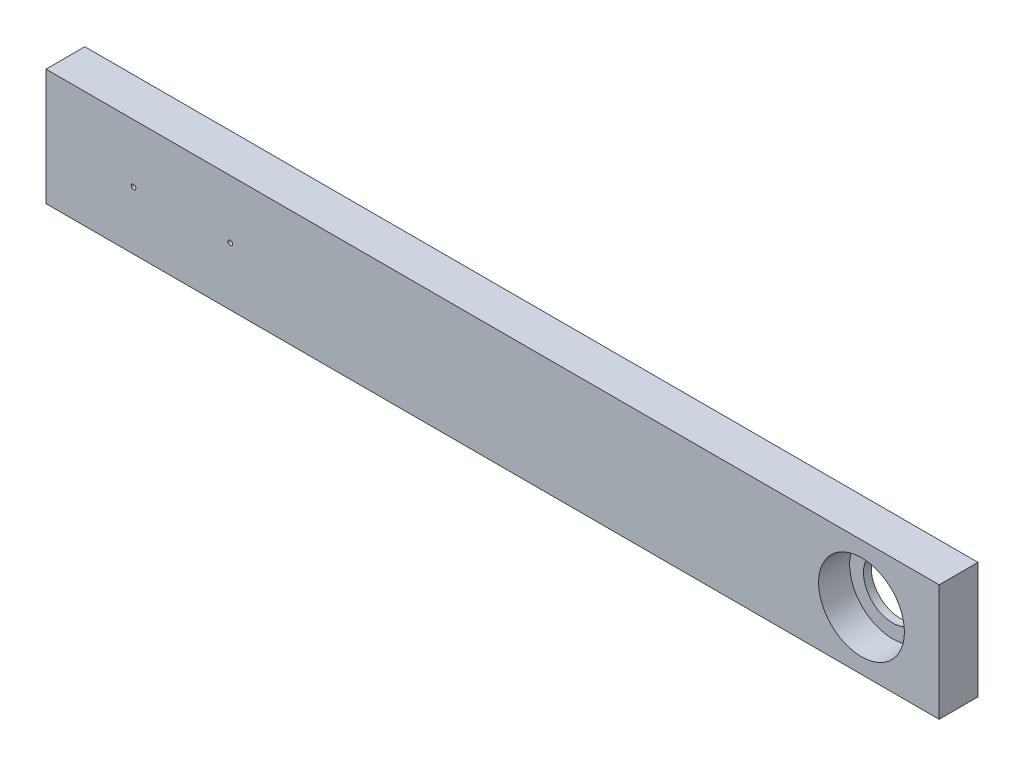
ISO-10303-21;
HEADER;
FILE_DESCRIPTION(('STEP AP214'),'2;1');
FILE_NAME('part.step','',(''),(''),'','','');
FILE_SCHEMA(('AUTOMOTIVE_DESIGN { 1 0 10303 214 1 1 1 1 }'));
ENDSEC;
DATA;
#1=APPLICATION_CONTEXT('core data for automotive mechanical design processes');
#2=APPLICATION_PROTOCOL_DEFINITION('international standard','automotive_design',2000,#1);
#3=PRODUCT_CONTEXT('',#1,'mechanical');
#4=PRODUCT('Part','Part','',(#3));
#5=PRODUCT_RELATED_PRODUCT_CATEGORY('part','',(#4));
#6=PRODUCT_DEFINITION_FORMATION('','',#4);
#7=PRODUCT_DEFINITION_CONTEXT('part definition',#1,'design');
#8=PRODUCT_DEFINITION('design','',#6,#7);
#9=PRODUCT_DEFINITION_SHAPE('','',#8);
#10=(LENGTH_UNIT() NAMED_UNIT(*) SI_UNIT(.MILLI.,.METRE.));
#11=(NAMED_UNIT(*) PLANE_ANGLE_UNIT() SI_UNIT($,.RADIAN.));
#12=(NAMED_UNIT(*) SI_UNIT($,.STERADIAN.) SOLID_ANGLE_UNIT());
#13=UNCERTAINTY_MEASURE_WITH_UNIT(LENGTH_MEASURE(1.E-05),#10,'distance_accuracy_value','');
#14=(GEOMETRIC_REPRESENTATION_CONTEXT(3) GLOBAL_UNCERTAINTY_ASSIGNED_CONTEXT((#13)) GLOBAL_UNIT_ASSIGNED_CONTEXT((#10,
#11,#12)) REPRESENTATION_CONTEXT('',''));
#15=CARTESIAN_POINT('',(0.,0.,0.));
#16=DIRECTION('',(0.,0.,1.));
#17=DIRECTION('',(1.,0.,0.));
#18=AXIS2_PLACEMENT_3D('',#15,#16,#17);
#19=CARTESIAN_POINT('',(0.,0.,10.));
#20=DIRECTION('',(0.,1.,0.));
#21=DIRECTION('',(-1.,0.,0.));
#22=AXIS2_PLACEMENT_3D('',#19,#20,#21);
#23=PLANE('',#22);
#24=DIRECTION('',(1.,0.,0.));
#25=VECTOR('',#24,1.);
#26=CARTESIAN_POINT('',(0.,0.,0.));
#27=LINE('',#26,#25);
#28=CARTESIAN_POINT('',(0.,0.,0.));
#29=VERTEX_POINT('',#28);
#30=CARTESIAN_POINT('',(230.,0.,0.));
#31=VERTEX_POINT('',#30);
#32=EDGE_CURVE('E112',#29,#31,#27,.T.);
#33=ORIENTED_EDGE('',*,*,#32,.T.);
#34=DIRECTION('',(0.,0.,-1.));
#35=VECTOR('',#34,1.);
#36=CARTESIAN_POINT('',(230.,0.,10.));
#37=LINE('',#36,#35);
#38=CARTESIAN_POINT('',(230.,0.,10.));
#39=VERTEX_POINT('',#38);
#40=EDGE_CURVE('E48',#39,#31,#37,.T.);
#41=ORIENTED_EDGE('',*,*,#40,.F.);
#42=DIRECTION('',(1.,0.,0.));
#43=VECTOR('',#42,1.);
#44=CARTESIAN_POINT('',(0.,0.,10.));
#45=LINE('',#44,#43);
#46=CARTESIAN_POINT('',(0.,0.,10.));
#47=VERTEX_POINT('',#46);
#48=EDGE_CURVE('E80',#47,#39,#45,.T.);
#49=ORIENTED_EDGE('',*,*,#48,.F.);
#50=DIRECTION('',(0.,0.,-1.));
#51=VECTOR('',#50,1.);
#52=CARTESIAN_POINT('',(0.,0.,10.));
#53=LINE('',#52,#51);
#54=EDGE_CURVE('E111',#47,#29,#53,.T.);
#55=ORIENTED_EDGE('',*,*,#54,.T.);
#56=EDGE_LOOP('',(#33,#41,#49,#55));
#57=FACE_BOUND('',#56,.T.);
#58=ADVANCED_FACE('F39',(#57),#23,.F.);
#59=CARTESIAN_POINT('',(230.,0.,10.));
#60=DIRECTION('',(1.,0.,0.));
#61=DIRECTION('',(0.,0.,-1.));
#62=AXIS2_PLACEMENT_3D('',#59,#60,#61);
#63=PLANE('',#62);
#64=DIRECTION('',(0.,-1.,0.));
#65=VECTOR('',#64,1.);
#66=CARTESIAN_POINT('',(230.,0.,0.));
#67=LINE('',#66,#65);
#68=CARTESIAN_POINT('',(230.,30.,0.));
#69=VERTEX_POINT('',#68);
#70=EDGE_CURVE('E90',#69,#31,#67,.T.);
#71=ORIENTED_EDGE('',*,*,#70,.F.);
#72=DIRECTION('',(0.,0.,-1.));
#73=VECTOR('',#72,1.);
#74=CARTESIAN_POINT('',(230.,30.,10.));
#75=LINE('',#74,#73);
#76=CARTESIAN_POINT('',(230.,30.,10.));
#77=VERTEX_POINT('',#76);
#78=EDGE_CURVE('E86',#77,#69,#75,.T.);
#79=ORIENTED_EDGE('',*,*,#78,.F.);
#80=DIRECTION('',(0.,-1.,0.));
#81=VECTOR('',#80,1.);
#82=CARTESIAN_POINT('',(230.,0.,10.));
#83=LINE('',#82,#81);
#84=EDGE_CURVE('E88',#77,#39,#83,.T.);
#85=ORIENTED_EDGE('',*,*,#84,.T.);
#86=ORIENTED_EDGE('',*,*,#40,.T.);
#87=EDGE_LOOP('',(#71,#79,#85,#86));
#88=FACE_BOUND('',#87,.T.);
#89=ADVANCED_FACE('F87',(#88),#63,.T.);
#90=CARTESIAN_POINT('',(0.,30.,10.));
#91=DIRECTION('',(0.,1.,0.));
#92=DIRECTION('',(-1.,0.,0.));
#93=AXIS2_PLACEMENT_3D('',#90,#91,#92);
#94=PLANE('',#93);
#95=DIRECTION('',(1.,0.,0.));
#96=VECTOR('',#95,1.);
#97=CARTESIAN_POINT('',(0.,30.,0.));
#98=LINE('',#97,#96);
#99=CARTESIAN_POINT('',(0.,30.,0.));
#100=VERTEX_POINT('',#99);
#101=EDGE_CURVE('E117',#100,#69,#98,.T.);
#102=ORIENTED_EDGE('',*,*,#101,.F.);
#103=DIRECTION('',(0.,0.,-1.));
#104=VECTOR('',#103,1.);
#105=CARTESIAN_POINT('',(0.,30.,10.));
#106=LINE('',#105,#104);
#107=CARTESIAN_POINT('',(0.,30.,10.));
#108=VERTEX_POINT('',#107);
#109=EDGE_CURVE('E72',#108,#100,#106,.T.);
#110=ORIENTED_EDGE('',*,*,#109,.F.);
#111=DIRECTION('',(1.,0.,0.));
#112=VECTOR('',#111,1.);
#113=CARTESIAN_POINT('',(0.,30.,10.));
#114=LINE('',#113,#112);
#115=EDGE_CURVE('E98',#108,#77,#114,.T.);
#116=ORIENTED_EDGE('',*,*,#115,.T.);
#117=ORIENTED_EDGE('',*,*,#78,.T.);
#118=EDGE_LOOP('',(#102,#110,#116,#117));
#119=FACE_BOUND('',#118,.T.);
#120=ADVANCED_FACE('F100',(#119),#94,.T.);
#121=CARTESIAN_POINT('',(22.55,15.,10.));
#122=DIRECTION('',(0.,0.,-1.));
#123=DIRECTION('',(-1.,0.,0.));
#124=AXIS2_PLACEMENT_3D('',#121,#122,#123);
#125=CYLINDRICAL_SURFACE('',#124,0.6);
#126=CARTESIAN_POINT('',(22.55,15.,10.));
#127=DIRECTION('',(0.,0.,1.));
#128=DIRECTION('',(1.,0.,0.));
#129=AXIS2_PLACEMENT_3D('',#126,#127,#128);
#130=CIRCLE('',#129,0.6);
#131=CARTESIAN_POINT('',(23.15,15.,10.));
#132=VERTEX_POINT('',#131);
#133=EDGE_CURVE('E102',#132,#132,#130,.T.);
#134=ORIENTED_EDGE('',*,*,#133,.T.);
#135=EDGE_LOOP('',(#134));
#136=FACE_BOUND('',#135,.T.);
#137=CARTESIAN_POINT('',(22.55,15.,0.));
#138=DIRECTION('',(0.,0.,1.));
#139=DIRECTION('',(1.,0.,0.));
#140=AXIS2_PLACEMENT_3D('',#137,#138,#139);
#141=CIRCLE('',#140,0.6);
#142=CARTESIAN_POINT('',(23.15,15.,0.));
#143=VERTEX_POINT('',#142);
#144=EDGE_CURVE('E120',#143,#143,#141,.T.);
#145=ORIENTED_EDGE('',*,*,#144,.F.);
#146=EDGE_LOOP('',(#145));
#147=FACE_BOUND('',#146,.T.);
#148=ADVANCED_FACE('F169',(#136,#147),#125,.F.);
#149=CARTESIAN_POINT('',(0.,0.,10.));
#150=DIRECTION('',(1.,0.,0.));
#151=DIRECTION('',(0.,0.,-1.));
#152=AXIS2_PLACEMENT_3D('',#149,#150,#151);
#153=PLANE('',#152);
#154=DIRECTION('',(0.,-1.,0.));
#155=VECTOR('',#154,1.);
#156=CARTESIAN_POINT('',(0.,0.,0.));
#157=LINE('',#156,#155);
#158=EDGE_CURVE('E75',#100,#29,#157,.T.);
#159=ORIENTED_EDGE('',*,*,#158,.T.);
#160=ORIENTED_EDGE('',*,*,#54,.F.);
#161=DIRECTION('',(0.,-1.,0.));
#162=VECTOR('',#161,1.);
#163=CARTESIAN_POINT('',(0.,0.,10.));
#164=LINE('',#163,#162);
#165=EDGE_CURVE('E56',#108,#47,#164,.T.);
#166=ORIENTED_EDGE('',*,*,#165,.F.);
#167=ORIENTED_EDGE('',*,*,#109,.T.);
#168=EDGE_LOOP('',(#159,#160,#166,#167));
#169=FACE_BOUND('',#168,.T.);
#170=ADVANCED_FACE('F170',(#169),#153,.F.);
#171=CARTESIAN_POINT('',(210.,15.,10.));
#172=DIRECTION('',(0.,0.,-1.));
#173=DIRECTION('',(-1.,0.,0.));
#174=AXIS2_PLACEMENT_3D('',#171,#172,#173);
#175=CYLINDRICAL_SURFACE('',#174,11.05);
#176=CARTESIAN_POINT('',(210.,15.,2.));
#177=DIRECTION('',(0.,0.,1.));
#178=DIRECTION('',(1.,0.,0.));
#179=AXIS2_PLACEMENT_3D('',#176,#177,#178);
#180=CIRCLE('',#179,11.05);
#181=CARTESIAN_POINT('',(221.05,15.,2.));
#182=VERTEX_POINT('',#181);
#183=EDGE_CURVE('E11',#182,#182,#180,.T.);
#184=ORIENTED_EDGE('',*,*,#183,.F.);
#185=EDGE_LOOP('',(#184));
#186=FACE_BOUND('',#185,.T.);
#187=CARTESIAN_POINT('',(210.,15.,10.));
#188=DIRECTION('',(0.,0.,1.));
#189=DIRECTION('',(1.,0.,0.));
#190=AXIS2_PLACEMENT_3D('',#187,#188,#189);
#191=CIRCLE('',#190,11.05);
#192=CARTESIAN_POINT('',(221.05,15.,10.));
#193=VERTEX_POINT('',#192);
#194=EDGE_CURVE('E126',#193,#193,#191,.T.);
#195=ORIENTED_EDGE('',*,*,#194,.T.);
#196=EDGE_LOOP('',(#195));
#197=FACE_BOUND('',#196,.T.);
#198=ADVANCED_FACE('F41',(#186,#197),#175,.F.);
#199=CARTESIAN_POINT('',(47.45,15.,10.));
#200=DIRECTION('',(0.,0.,-1.));
#201=DIRECTION('',(-1.,0.,0.));
#202=AXIS2_PLACEMENT_3D('',#199,#200,#201);
#203=CYLINDRICAL_SURFACE('',#202,0.600000000000001);
#204=CARTESIAN_POINT('',(47.45,15.,10.));
#205=DIRECTION('',(0.,0.,1.));
#206=DIRECTION('',(1.,0.,0.));
#207=AXIS2_PLACEMENT_3D('',#204,#205,#206);
#208=CIRCLE('',#207,0.600000000000001);
#209=CARTESIAN_POINT('',(48.05,15.,10.));
#210=VERTEX_POINT('',#209);
#211=EDGE_CURVE('E108',#210,#210,#208,.F.);
#212=ORIENTED_EDGE('',*,*,#211,.F.);
#213=EDGE_LOOP('',(#212));
#214=FACE_BOUND('',#213,.T.);
#215=CARTESIAN_POINT('',(47.45,15.,0.));
#216=DIRECTION('',(0.,0.,1.));
#217=DIRECTION('',(1.,0.,0.));
#218=AXIS2_PLACEMENT_3D('',#215,#216,#217);
#219=CIRCLE('',#218,0.600000000000001);
#220=CARTESIAN_POINT('',(48.05,15.,0.));
#221=VERTEX_POINT('',#220);
#222=EDGE_CURVE('E123',#221,#221,#219,.F.);
#223=ORIENTED_EDGE('',*,*,#222,.T.);
#224=EDGE_LOOP('',(#223));
#225=FACE_BOUND('',#224,.T.);
#226=ADVANCED_FACE('F153',(#214,#225),#203,.F.);
#227=CARTESIAN_POINT('',(0.,0.,10.));
#228=DIRECTION('',(0.,0.,1.));
#229=DIRECTION('',(1.,0.,0.));
#230=AXIS2_PLACEMENT_3D('',#227,#228,#229);
#231=PLANE('',#230);
#232=ORIENTED_EDGE('',*,*,#194,.F.);
#233=EDGE_LOOP('',(#232));
#234=FACE_BOUND('',#233,.T.);
#235=ORIENTED_EDGE('',*,*,#48,.T.);
#236=ORIENTED_EDGE('',*,*,#84,.F.);
#237=ORIENTED_EDGE('',*,*,#115,.F.);
#238=ORIENTED_EDGE('',*,*,#165,.T.);
#239=EDGE_LOOP('',(#235,#236,#237,#238));
#240=FACE_BOUND('',#239,.T.);
#241=ORIENTED_EDGE('',*,*,#133,.F.);
#242=EDGE_LOOP('',(#241));
#243=FACE_BOUND('',#242,.T.);
#244=ORIENTED_EDGE('',*,*,#211,.T.);
#245=EDGE_LOOP('',(#244));
#246=FACE_BOUND('',#245,.T.);
#247=ADVANCED_FACE('F96',(#234,#240,#243,#246),#231,.T.);
#248=CARTESIAN_POINT('',(0.,0.,0.));
#249=DIRECTION('',(0.,0.,1.));
#250=DIRECTION('',(1.,0.,0.));
#251=AXIS2_PLACEMENT_3D('',#248,#249,#250);
#252=PLANE('',#251);
#253=ORIENTED_EDGE('',*,*,#32,.F.);
#254=ORIENTED_EDGE('',*,*,#158,.F.);
#255=ORIENTED_EDGE('',*,*,#101,.T.);
#256=ORIENTED_EDGE('',*,*,#70,.T.);
#257=EDGE_LOOP('',(#253,#254,#255,#256));
#258=FACE_BOUND('',#257,.T.);
#259=ORIENTED_EDGE('',*,*,#144,.T.);
#260=EDGE_LOOP('',(#259));
#261=FACE_BOUND('',#260,.T.);
#262=ORIENTED_EDGE('',*,*,#222,.F.);
#263=EDGE_LOOP('',(#262));
#264=FACE_BOUND('',#263,.T.);
#265=CARTESIAN_POINT('',(210.,15.,0.));
#266=DIRECTION('',(0.,0.,1.));
#267=DIRECTION('',(1.,0.,0.));
#268=AXIS2_PLACEMENT_3D('',#265,#266,#267);
#269=CIRCLE('',#268,7.50000000000001);
#270=CARTESIAN_POINT('',(217.5,15.,0.));
#271=VERTEX_POINT('',#270);
#272=EDGE_CURVE('E142',#271,#271,#269,.T.);
#273=ORIENTED_EDGE('',*,*,#272,.T.);
#274=EDGE_LOOP('',(#273));
#275=FACE_BOUND('',#274,.T.);
#276=ADVANCED_FACE('F131',(#258,#261,#264,#275),#252,.F.);
#277=CARTESIAN_POINT('',(210.,15.,2.));
#278=DIRECTION('',(0.,0.,-1.));
#279=DIRECTION('',(-1.,0.,0.));
#280=AXIS2_PLACEMENT_3D('',#277,#278,#279);
#281=CYLINDRICAL_SURFACE('',#280,7.50000000000001);
#282=CARTESIAN_POINT('',(210.,15.,2.));
#283=DIRECTION('',(0.,0.,1.));
#284=DIRECTION('',(1.,0.,0.));
#285=AXIS2_PLACEMENT_3D('',#282,#283,#284);
#286=CIRCLE('',#285,7.50000000000001);
#287=CARTESIAN_POINT('',(217.5,15.,2.));
#288=VERTEX_POINT('',#287);
#289=EDGE_CURVE('E115',#288,#288,#286,.T.);
#290=ORIENTED_EDGE('',*,*,#289,.T.);
#291=EDGE_LOOP('',(#290));
#292=FACE_BOUND('',#291,.T.);
#293=ORIENTED_EDGE('',*,*,#272,.F.);
#294=EDGE_LOOP('',(#293));
#295=FACE_BOUND('',#294,.T.);
#296=ADVANCED_FACE('F134',(#292,#295),#281,.F.);
#297=CARTESIAN_POINT('',(0.,0.,2.));
#298=DIRECTION('',(0.,0.,1.));
#299=DIRECTION('',(1.,0.,0.));
#300=AXIS2_PLACEMENT_3D('',#297,#298,#299);
#301=PLANE('',#300);
#302=ORIENTED_EDGE('',*,*,#289,.F.);
#303=EDGE_LOOP('',(#302));
#304=FACE_BOUND('',#303,.T.);
#305=ORIENTED_EDGE('',*,*,#183,.T.);
#306=EDGE_LOOP('',(#305));
#307=FACE_BOUND('',#306,.T.);
#308=ADVANCED_FACE('F233',(#304,#307),#301,.T.);
#309=CLOSED_SHELL('',(#58,#89,#120,#148,#170,#198,#226,#247,#276,#296,#308));
#310=MANIFOLD_SOLID_BREP('B2',#309);
#311=ADVANCED_BREP_SHAPE_REPRESENTATION('',(#18,#310),#14);
#312=SHAPE_DEFINITION_REPRESENTATION(#9,#311);
ENDSEC;
END-ISO-10303-21;
